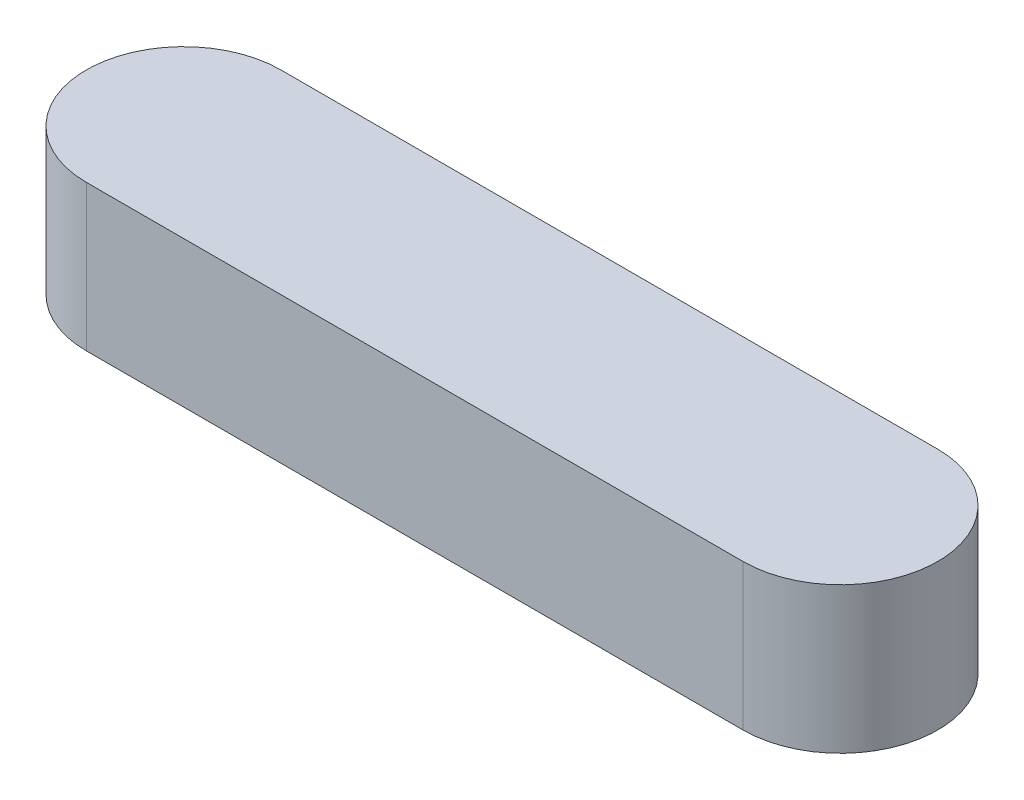
ISO-10303-21;
HEADER;
FILE_DESCRIPTION(('STEP AP214'),'2;1');
FILE_NAME('part.step','',(''),(''),'','','');
FILE_SCHEMA(('AUTOMOTIVE_DESIGN { 1 0 10303 214 1 1 1 1 }'));
ENDSEC;
DATA;
#1=APPLICATION_CONTEXT('core data for automotive mechanical design processes');
#2=APPLICATION_PROTOCOL_DEFINITION('international standard','automotive_design',2000,#1);
#3=PRODUCT_CONTEXT('',#1,'mechanical');
#4=PRODUCT('Part','Part','',(#3));
#5=PRODUCT_RELATED_PRODUCT_CATEGORY('part','',(#4));
#6=PRODUCT_DEFINITION_FORMATION('','',#4);
#7=PRODUCT_DEFINITION_CONTEXT('part definition',#1,'design');
#8=PRODUCT_DEFINITION('design','',#6,#7);
#9=PRODUCT_DEFINITION_SHAPE('','',#8);
#10=(LENGTH_UNIT() NAMED_UNIT(*) SI_UNIT(.MILLI.,.METRE.));
#11=(NAMED_UNIT(*) PLANE_ANGLE_UNIT() SI_UNIT($,.RADIAN.));
#12=(NAMED_UNIT(*) SI_UNIT($,.STERADIAN.) SOLID_ANGLE_UNIT());
#13=UNCERTAINTY_MEASURE_WITH_UNIT(LENGTH_MEASURE(1.E-05),#10,'distance_accuracy_value','');
#14=(GEOMETRIC_REPRESENTATION_CONTEXT(3) GLOBAL_UNCERTAINTY_ASSIGNED_CONTEXT((#13)) GLOBAL_UNIT_ASSIGNED_CONTEXT((#10,
#11,#12)) REPRESENTATION_CONTEXT('',''));
#15=CARTESIAN_POINT('',(0.,0.,0.));
#16=DIRECTION('',(0.,0.,1.));
#17=DIRECTION('',(1.,0.,0.));
#18=AXIS2_PLACEMENT_3D('',#15,#16,#17);
#19=CARTESIAN_POINT('',(-27.,12.,0.));
#20=DIRECTION('',(0.,-1.,0.));
#21=DIRECTION('',(0.,0.,-1.));
#22=AXIS2_PLACEMENT_3D('',#19,#20,#21);
#23=CYLINDRICAL_SURFACE('',#22,8.00000000000001);
#24=CARTESIAN_POINT('',(-27.,0.,0.));
#25=DIRECTION('',(0.,1.,0.));
#26=DIRECTION('',(0.,0.,1.));
#27=AXIS2_PLACEMENT_3D('',#24,#25,#26);
#28=CIRCLE('',#27,8.00000000000001);
#29=CARTESIAN_POINT('',(-27.,0.,-8.00000000000001));
#30=VERTEX_POINT('',#29);
#31=CARTESIAN_POINT('',(-27.,0.,8.00000000000001));
#32=VERTEX_POINT('',#31);
#33=EDGE_CURVE('E96',#30,#32,#28,.T.);
#34=ORIENTED_EDGE('',*,*,#33,.T.);
#35=DIRECTION('',(0.,-1.,0.));
#36=VECTOR('',#35,1.);
#37=CARTESIAN_POINT('',(-27.,12.,8.00000000000001));
#38=LINE('',#37,#36);
#39=CARTESIAN_POINT('',(-27.,12.,8.00000000000001));
#40=VERTEX_POINT('',#39);
#41=EDGE_CURVE('E11',#40,#32,#38,.T.);
#42=ORIENTED_EDGE('',*,*,#41,.F.);
#43=CARTESIAN_POINT('',(-27.,12.,0.));
#44=DIRECTION('',(0.,1.,0.));
#45=DIRECTION('',(0.,0.,1.));
#46=AXIS2_PLACEMENT_3D('',#43,#44,#45);
#47=CIRCLE('',#46,8.00000000000001);
#48=CARTESIAN_POINT('',(-27.,12.,-8.00000000000001));
#49=VERTEX_POINT('',#48);
#50=EDGE_CURVE('E84',#49,#40,#47,.T.);
#51=ORIENTED_EDGE('',*,*,#50,.F.);
#52=DIRECTION('',(0.,-1.,0.));
#53=VECTOR('',#52,1.);
#54=CARTESIAN_POINT('',(-27.,12.,-8.00000000000001));
#55=LINE('',#54,#53);
#56=EDGE_CURVE('E92',#49,#30,#55,.T.);
#57=ORIENTED_EDGE('',*,*,#56,.T.);
#58=EDGE_LOOP('',(#34,#42,#51,#57));
#59=FACE_BOUND('',#58,.T.);
#60=ADVANCED_FACE('F33',(#59),#23,.T.);
#61=CARTESIAN_POINT('',(-27.,12.,8.00000000000001));
#62=DIRECTION('',(0.,0.,-1.));
#63=DIRECTION('',(-1.,0.,0.));
#64=AXIS2_PLACEMENT_3D('',#61,#62,#63);
#65=PLANE('',#64);
#66=DIRECTION('',(1.,0.,0.));
#67=VECTOR('',#66,1.);
#68=CARTESIAN_POINT('',(-27.,0.,8.00000000000001));
#69=LINE('',#68,#67);
#70=CARTESIAN_POINT('',(27.,0.,8.));
#71=VERTEX_POINT('',#70);
#72=EDGE_CURVE('E88',#32,#71,#69,.T.);
#73=ORIENTED_EDGE('',*,*,#72,.T.);
#74=DIRECTION('',(0.,-1.,0.));
#75=VECTOR('',#74,1.);
#76=CARTESIAN_POINT('',(27.,12.,8.));
#77=LINE('',#76,#75);
#78=CARTESIAN_POINT('',(27.,12.,8.));
#79=VERTEX_POINT('',#78);
#80=EDGE_CURVE('E41',#79,#71,#77,.T.);
#81=ORIENTED_EDGE('',*,*,#80,.F.);
#82=DIRECTION('',(1.,0.,0.));
#83=VECTOR('',#82,1.);
#84=CARTESIAN_POINT('',(-27.,12.,8.00000000000001));
#85=LINE('',#84,#83);
#86=EDGE_CURVE('E79',#40,#79,#85,.T.);
#87=ORIENTED_EDGE('',*,*,#86,.F.);
#88=ORIENTED_EDGE('',*,*,#41,.T.);
#89=EDGE_LOOP('',(#73,#81,#87,#88));
#90=FACE_BOUND('',#89,.T.);
#91=ADVANCED_FACE('F87',(#90),#65,.F.);
#92=CARTESIAN_POINT('',(27.,12.,0.));
#93=DIRECTION('',(0.,-1.,0.));
#94=DIRECTION('',(0.,0.,-1.));
#95=AXIS2_PLACEMENT_3D('',#92,#93,#94);
#96=CYLINDRICAL_SURFACE('',#95,8.00000000000001);
#97=CARTESIAN_POINT('',(27.,0.,0.));
#98=DIRECTION('',(0.,1.,0.));
#99=DIRECTION('',(0.,0.,1.));
#100=AXIS2_PLACEMENT_3D('',#97,#98,#99);
#101=CIRCLE('',#100,8.00000000000001);
#102=CARTESIAN_POINT('',(27.,0.,-8.00000000000002));
#103=VERTEX_POINT('',#102);
#104=EDGE_CURVE('E66',#71,#103,#101,.T.);
#105=ORIENTED_EDGE('',*,*,#104,.T.);
#106=DIRECTION('',(0.,-1.,0.));
#107=VECTOR('',#106,1.);
#108=CARTESIAN_POINT('',(27.,12.,-8.00000000000002));
#109=LINE('',#108,#107);
#110=CARTESIAN_POINT('',(27.,12.,-8.00000000000002));
#111=VERTEX_POINT('',#110);
#112=EDGE_CURVE('E89',#111,#103,#109,.T.);
#113=ORIENTED_EDGE('',*,*,#112,.F.);
#114=CARTESIAN_POINT('',(27.,12.,0.));
#115=DIRECTION('',(0.,1.,0.));
#116=DIRECTION('',(0.,0.,1.));
#117=AXIS2_PLACEMENT_3D('',#114,#115,#116);
#118=CIRCLE('',#117,8.00000000000001);
#119=EDGE_CURVE('E82',#79,#111,#118,.T.);
#120=ORIENTED_EDGE('',*,*,#119,.F.);
#121=ORIENTED_EDGE('',*,*,#80,.T.);
#122=EDGE_LOOP('',(#105,#113,#120,#121));
#123=FACE_BOUND('',#122,.T.);
#124=ADVANCED_FACE('F90',(#123),#96,.T.);
#125=CARTESIAN_POINT('',(-27.,12.,-8.00000000000001));
#126=DIRECTION('',(0.,0.,1.));
#127=DIRECTION('',(1.,0.,0.));
#128=AXIS2_PLACEMENT_3D('',#125,#126,#127);
#129=PLANE('',#128);
#130=DIRECTION('',(-1.,0.,0.));
#131=VECTOR('',#130,1.);
#132=CARTESIAN_POINT('',(-27.,0.,-8.00000000000001));
#133=LINE('',#132,#131);
#134=EDGE_CURVE('E72',#103,#30,#133,.T.);
#135=ORIENTED_EDGE('',*,*,#134,.T.);
#136=ORIENTED_EDGE('',*,*,#56,.F.);
#137=DIRECTION('',(-1.,0.,0.));
#138=VECTOR('',#137,1.);
#139=CARTESIAN_POINT('',(-27.,12.,-8.00000000000001));
#140=LINE('',#139,#138);
#141=EDGE_CURVE('E49',#111,#49,#140,.T.);
#142=ORIENTED_EDGE('',*,*,#141,.F.);
#143=ORIENTED_EDGE('',*,*,#112,.T.);
#144=EDGE_LOOP('',(#135,#136,#142,#143));
#145=FACE_BOUND('',#144,.T.);
#146=ADVANCED_FACE('F103',(#145),#129,.F.);
#147=CARTESIAN_POINT('',(-27.,12.,0.));
#148=DIRECTION('',(0.,1.,0.));
#149=DIRECTION('',(0.,0.,1.));
#150=AXIS2_PLACEMENT_3D('',#147,#148,#149);
#151=PLANE('',#150);
#152=ORIENTED_EDGE('',*,*,#50,.T.);
#153=ORIENTED_EDGE('',*,*,#86,.T.);
#154=ORIENTED_EDGE('',*,*,#119,.T.);
#155=ORIENTED_EDGE('',*,*,#141,.T.);
#156=EDGE_LOOP('',(#152,#153,#154,#155));
#157=FACE_BOUND('',#156,.T.);
#158=ADVANCED_FACE('F80',(#157),#151,.T.);
#159=CARTESIAN_POINT('',(-27.,0.,0.));
#160=DIRECTION('',(0.,1.,0.));
#161=DIRECTION('',(0.,0.,1.));
#162=AXIS2_PLACEMENT_3D('',#159,#160,#161);
#163=PLANE('',#162);
#164=ORIENTED_EDGE('',*,*,#33,.F.);
#165=ORIENTED_EDGE('',*,*,#134,.F.);
#166=ORIENTED_EDGE('',*,*,#104,.F.);
#167=ORIENTED_EDGE('',*,*,#72,.F.);
#168=EDGE_LOOP('',(#164,#165,#166,#167));
#169=FACE_BOUND('',#168,.T.);
#170=ADVANCED_FACE('F106',(#169),#163,.F.);
#171=CLOSED_SHELL('',(#60,#91,#124,#146,#158,#170));
#172=MANIFOLD_SOLID_BREP('B2',#171);
#173=ADVANCED_BREP_SHAPE_REPRESENTATION('',(#18,#172),#14);
#174=SHAPE_DEFINITION_REPRESENTATION(#9,#173);
ENDSEC;
END-ISO-10303-21;
